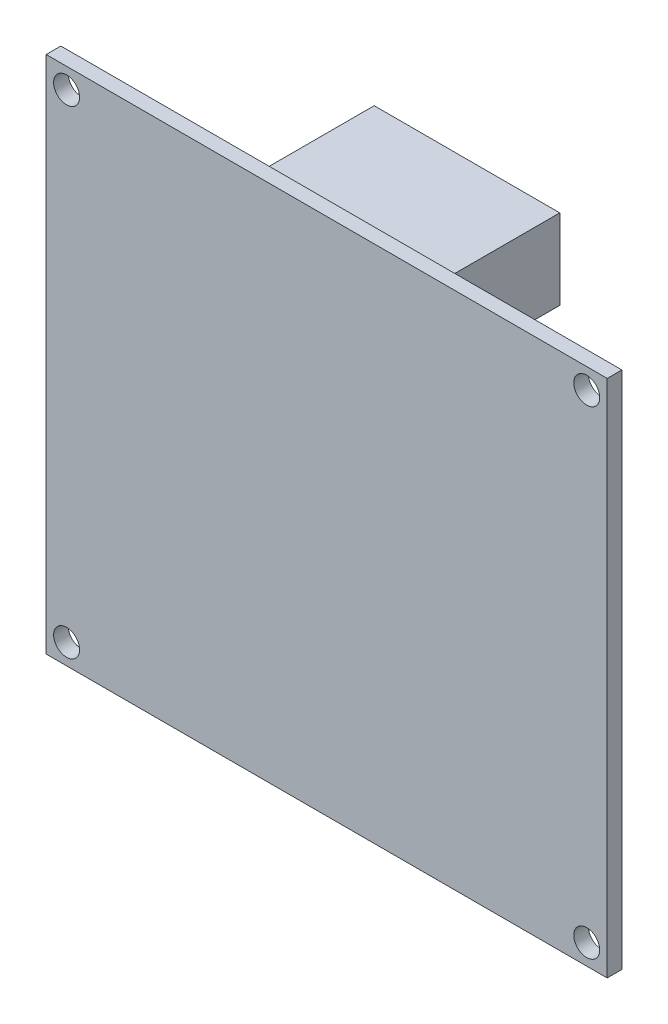
ISO-10303-21;
HEADER;
FILE_DESCRIPTION(('STEP AP214'),'2;1');
FILE_NAME('part.step','',(''),(''),'','','');
FILE_SCHEMA(('AUTOMOTIVE_DESIGN { 1 0 10303 214 1 1 1 1 }'));
ENDSEC;
DATA;
#1=APPLICATION_CONTEXT('core data for automotive mechanical design processes');
#2=APPLICATION_PROTOCOL_DEFINITION('international standard','automotive_design',2000,#1);
#3=PRODUCT_CONTEXT('',#1,'mechanical');
#4=PRODUCT('Part','Part','',(#3));
#5=PRODUCT_RELATED_PRODUCT_CATEGORY('part','',(#4));
#6=PRODUCT_DEFINITION_FORMATION('','',#4);
#7=PRODUCT_DEFINITION_CONTEXT('part definition',#1,'design');
#8=PRODUCT_DEFINITION('design','',#6,#7);
#9=PRODUCT_DEFINITION_SHAPE('','',#8);
#10=(LENGTH_UNIT() NAMED_UNIT(*) SI_UNIT(.MILLI.,.METRE.));
#11=(NAMED_UNIT(*) PLANE_ANGLE_UNIT() SI_UNIT($,.RADIAN.));
#12=(NAMED_UNIT(*) SI_UNIT($,.STERADIAN.) SOLID_ANGLE_UNIT());
#13=UNCERTAINTY_MEASURE_WITH_UNIT(LENGTH_MEASURE(1.E-05),#10,'distance_accuracy_value','');
#14=(GEOMETRIC_REPRESENTATION_CONTEXT(3) GLOBAL_UNCERTAINTY_ASSIGNED_CONTEXT((#13)) GLOBAL_UNIT_ASSIGNED_CONTEXT((#10,
#11,#12)) REPRESENTATION_CONTEXT('',''));
#15=CARTESIAN_POINT('',(0.,0.,0.));
#16=DIRECTION('',(0.,0.,1.));
#17=DIRECTION('',(1.,0.,0.));
#18=AXIS2_PLACEMENT_3D('',#15,#16,#17);
#19=CARTESIAN_POINT('',(31.5595,29.21,-0.8255));
#20=DIRECTION('',(0.,0.,-1.));
#21=DIRECTION('',(-1.,0.,0.));
#22=AXIS2_PLACEMENT_3D('',#19,#20,#21);
#23=PLANE('',#22);
#24=CARTESIAN_POINT('',(-29.25826,-26.9113,-0.8255));
#25=DIRECTION('',(0.,0.,-1.));
#26=DIRECTION('',(-1.,0.,0.));
#27=AXIS2_PLACEMENT_3D('',#24,#25,#26);
#28=CIRCLE('',#27,1.4605);
#29=CARTESIAN_POINT('',(-30.71876,-26.9113,-0.8255));
#30=VERTEX_POINT('',#29);
#31=EDGE_CURVE('E222',#30,#30,#28,.T.);
#32=ORIENTED_EDGE('',*,*,#31,.F.);
#33=EDGE_LOOP('',(#32));
#34=FACE_BOUND('',#33,.T.);
#35=CARTESIAN_POINT('',(29.25826,-26.9113,-0.8255));
#36=DIRECTION('',(0.,0.,-1.));
#37=DIRECTION('',(-1.,0.,0.));
#38=AXIS2_PLACEMENT_3D('',#35,#36,#37);
#39=CIRCLE('',#38,1.4605);
#40=CARTESIAN_POINT('',(27.79776,-26.9113,-0.8255));
#41=VERTEX_POINT('',#40);
#42=EDGE_CURVE('E232',#41,#41,#39,.T.);
#43=ORIENTED_EDGE('',*,*,#42,.F.);
#44=EDGE_LOOP('',(#43));
#45=FACE_BOUND('',#44,.T.);
#46=CARTESIAN_POINT('',(29.25826,26.9113,-0.8255));
#47=DIRECTION('',(0.,0.,-1.));
#48=DIRECTION('',(-1.,0.,0.));
#49=AXIS2_PLACEMENT_3D('',#46,#47,#48);
#50=CIRCLE('',#49,1.4605);
#51=CARTESIAN_POINT('',(27.79776,26.9113,-0.8255));
#52=VERTEX_POINT('',#51);
#53=EDGE_CURVE('E238',#52,#52,#50,.T.);
#54=ORIENTED_EDGE('',*,*,#53,.F.);
#55=EDGE_LOOP('',(#54));
#56=FACE_BOUND('',#55,.T.);
#57=CARTESIAN_POINT('',(-29.25826,26.9113,-0.8255));
#58=DIRECTION('',(0.,0.,-1.));
#59=DIRECTION('',(-1.,0.,0.));
#60=AXIS2_PLACEMENT_3D('',#57,#58,#59);
#61=CIRCLE('',#60,1.4605);
#62=CARTESIAN_POINT('',(-30.71876,26.9113,-0.8255));
#63=VERTEX_POINT('',#62);
#64=EDGE_CURVE('E244',#63,#63,#61,.T.);
#65=ORIENTED_EDGE('',*,*,#64,.F.);
#66=EDGE_LOOP('',(#65));
#67=FACE_BOUND('',#66,.T.);
#68=DIRECTION('',(0.,1.,0.));
#69=VECTOR('',#68,1.);
#70=CARTESIAN_POINT('',(31.5595,-29.21,-0.8255));
#71=LINE('',#70,#69);
#72=CARTESIAN_POINT('',(31.5595,-29.21,-0.8255));
#73=VERTEX_POINT('',#72);
#74=CARTESIAN_POINT('',(31.5595,29.21,-0.8255));
#75=VERTEX_POINT('',#74);
#76=EDGE_CURVE('E136',#73,#75,#71,.T.);
#77=ORIENTED_EDGE('',*,*,#76,.F.);
#78=DIRECTION('',(1.,0.,0.));
#79=VECTOR('',#78,1.);
#80=CARTESIAN_POINT('',(-31.5595,-29.21,-0.8255));
#81=LINE('',#80,#79);
#82=CARTESIAN_POINT('',(-31.5595,-29.21,-0.8255));
#83=VERTEX_POINT('',#82);
#84=EDGE_CURVE('E82',#83,#73,#81,.T.);
#85=ORIENTED_EDGE('',*,*,#84,.F.);
#86=DIRECTION('',(0.,-1.,0.));
#87=VECTOR('',#86,1.);
#88=CARTESIAN_POINT('',(-31.5595,-29.21,-0.8255));
#89=LINE('',#88,#87);
#90=CARTESIAN_POINT('',(-31.5595,29.21,-0.8255));
#91=VERTEX_POINT('',#90);
#92=EDGE_CURVE('E152',#91,#83,#89,.T.);
#93=ORIENTED_EDGE('',*,*,#92,.F.);
#94=DIRECTION('',(-1.,0.,0.));
#95=VECTOR('',#94,1.);
#96=CARTESIAN_POINT('',(-31.5595,29.21,-0.8255));
#97=LINE('',#96,#95);
#98=EDGE_CURVE('E139',#75,#91,#97,.T.);
#99=ORIENTED_EDGE('',*,*,#98,.F.);
#100=EDGE_LOOP('',(#77,#85,#93,#99));
#101=FACE_BOUND('',#100,.T.);
#102=DIRECTION('',(-1.,0.,0.));
#103=VECTOR('',#102,1.);
#104=CARTESIAN_POINT('',(11.4935,18.923,-0.8255));
#105=LINE('',#104,#103);
#106=CARTESIAN_POINT('',(11.4935,18.923,-0.8255));
#107=VERTEX_POINT('',#106);
#108=CARTESIAN_POINT('',(-9.38529999999999,18.923,-0.8255));
#109=VERTEX_POINT('',#108);
#110=EDGE_CURVE('E251',#107,#109,#105,.T.);
#111=ORIENTED_EDGE('',*,*,#110,.F.);
#112=DIRECTION('',(0.,-1.,0.));
#113=VECTOR('',#112,1.);
#114=CARTESIAN_POINT('',(11.4935,18.923,-0.8255));
#115=LINE('',#114,#113);
#116=CARTESIAN_POINT('',(11.4935,27.94,-0.8255));
#117=VERTEX_POINT('',#116);
#118=EDGE_CURVE('E134',#117,#107,#115,.T.);
#119=ORIENTED_EDGE('',*,*,#118,.F.);
#120=DIRECTION('',(1.,0.,0.));
#121=VECTOR('',#120,1.);
#122=CARTESIAN_POINT('',(11.4935,27.94,-0.8255));
#123=LINE('',#122,#121);
#124=CARTESIAN_POINT('',(-9.38529999999999,27.94,-0.8255));
#125=VERTEX_POINT('',#124);
#126=EDGE_CURVE('E130',#125,#117,#123,.T.);
#127=ORIENTED_EDGE('',*,*,#126,.F.);
#128=DIRECTION('',(0.,1.,0.));
#129=VECTOR('',#128,1.);
#130=CARTESIAN_POINT('',(-9.38529999999999,18.923,-0.8255));
#131=LINE('',#130,#129);
#132=EDGE_CURVE('E253',#109,#125,#131,.T.);
#133=ORIENTED_EDGE('',*,*,#132,.F.);
#134=EDGE_LOOP('',(#111,#119,#127,#133));
#135=FACE_BOUND('',#134,.T.);
#136=ADVANCED_FACE('F37',(#34,#45,#56,#67,#101,#135),#23,.T.);
#137=CARTESIAN_POINT('',(31.5595,-29.21,0.8255));
#138=DIRECTION('',(-1.,0.,0.));
#139=DIRECTION('',(0.,0.,1.));
#140=AXIS2_PLACEMENT_3D('',#137,#138,#139);
#141=PLANE('',#140);
#142=ORIENTED_EDGE('',*,*,#76,.T.);
#143=DIRECTION('',(0.,0.,-1.));
#144=VECTOR('',#143,1.);
#145=CARTESIAN_POINT('',(31.5595,29.21,0.8255));
#146=LINE('',#145,#144);
#147=CARTESIAN_POINT('',(31.5595,29.21,0.8255));
#148=VERTEX_POINT('',#147);
#149=EDGE_CURVE('E11',#148,#75,#146,.T.);
#150=ORIENTED_EDGE('',*,*,#149,.F.);
#151=DIRECTION('',(0.,1.,0.));
#152=VECTOR('',#151,1.);
#153=CARTESIAN_POINT('',(31.5595,-29.21,0.8255));
#154=LINE('',#153,#152);
#155=CARTESIAN_POINT('',(31.5595,-29.21,0.8255));
#156=VERTEX_POINT('',#155);
#157=EDGE_CURVE('E144',#156,#148,#154,.T.);
#158=ORIENTED_EDGE('',*,*,#157,.F.);
#159=DIRECTION('',(0.,0.,-1.));
#160=VECTOR('',#159,1.);
#161=CARTESIAN_POINT('',(31.5595,-29.21,0.8255));
#162=LINE('',#161,#160);
#163=EDGE_CURVE('E149',#156,#73,#162,.T.);
#164=ORIENTED_EDGE('',*,*,#163,.T.);
#165=EDGE_LOOP('',(#142,#150,#158,#164));
#166=FACE_BOUND('',#165,.T.);
#167=ADVANCED_FACE('F39',(#166),#141,.F.);
#168=CARTESIAN_POINT('',(-31.5595,29.21,0.8255));
#169=DIRECTION('',(0.,-1.,0.));
#170=DIRECTION('',(1.,0.,0.));
#171=AXIS2_PLACEMENT_3D('',#168,#169,#170);
#172=PLANE('',#171);
#173=ORIENTED_EDGE('',*,*,#98,.T.);
#174=DIRECTION('',(0.,0.,-1.));
#175=VECTOR('',#174,1.);
#176=CARTESIAN_POINT('',(-31.5595,29.21,0.8255));
#177=LINE('',#176,#175);
#178=CARTESIAN_POINT('',(-31.5595,29.21,0.8255));
#179=VERTEX_POINT('',#178);
#180=EDGE_CURVE('E45',#179,#91,#177,.T.);
#181=ORIENTED_EDGE('',*,*,#180,.F.);
#182=DIRECTION('',(-1.,0.,0.));
#183=VECTOR('',#182,1.);
#184=CARTESIAN_POINT('',(-31.5595,29.21,0.8255));
#185=LINE('',#184,#183);
#186=EDGE_CURVE('E89',#148,#179,#185,.T.);
#187=ORIENTED_EDGE('',*,*,#186,.F.);
#188=ORIENTED_EDGE('',*,*,#149,.T.);
#189=EDGE_LOOP('',(#173,#181,#187,#188));
#190=FACE_BOUND('',#189,.T.);
#191=ADVANCED_FACE('F179',(#190),#172,.F.);
#192=CARTESIAN_POINT('',(-31.5595,-29.21,0.8255));
#193=DIRECTION('',(1.,0.,0.));
#194=DIRECTION('',(0.,0.,-1.));
#195=AXIS2_PLACEMENT_3D('',#192,#193,#194);
#196=PLANE('',#195);
#197=ORIENTED_EDGE('',*,*,#92,.T.);
#198=DIRECTION('',(0.,0.,-1.));
#199=VECTOR('',#198,1.);
#200=CARTESIAN_POINT('',(-31.5595,-29.21,0.8255));
#201=LINE('',#200,#199);
#202=CARTESIAN_POINT('',(-31.5595,-29.21,0.8255));
#203=VERTEX_POINT('',#202);
#204=EDGE_CURVE('E156',#203,#83,#201,.T.);
#205=ORIENTED_EDGE('',*,*,#204,.F.);
#206=DIRECTION('',(0.,-1.,0.));
#207=VECTOR('',#206,1.);
#208=CARTESIAN_POINT('',(-31.5595,-29.21,0.8255));
#209=LINE('',#208,#207);
#210=EDGE_CURVE('E147',#179,#203,#209,.T.);
#211=ORIENTED_EDGE('',*,*,#210,.F.);
#212=ORIENTED_EDGE('',*,*,#180,.T.);
#213=EDGE_LOOP('',(#197,#205,#211,#212));
#214=FACE_BOUND('',#213,.T.);
#215=ADVANCED_FACE('F161',(#214),#196,.F.);
#216=CARTESIAN_POINT('',(-31.5595,-29.21,0.8255));
#217=DIRECTION('',(0.,1.,0.));
#218=DIRECTION('',(0.,0.,1.));
#219=AXIS2_PLACEMENT_3D('',#216,#217,#218);
#220=PLANE('',#219);
#221=ORIENTED_EDGE('',*,*,#84,.T.);
#222=ORIENTED_EDGE('',*,*,#163,.F.);
#223=DIRECTION('',(1.,0.,0.));
#224=VECTOR('',#223,1.);
#225=CARTESIAN_POINT('',(-31.5595,-29.21,0.8255));
#226=LINE('',#225,#224);
#227=EDGE_CURVE('E61',#203,#156,#226,.T.);
#228=ORIENTED_EDGE('',*,*,#227,.F.);
#229=ORIENTED_EDGE('',*,*,#204,.T.);
#230=EDGE_LOOP('',(#221,#222,#228,#229));
#231=FACE_BOUND('',#230,.T.);
#232=ADVANCED_FACE('F169',(#231),#220,.F.);
#233=CARTESIAN_POINT('',(31.5595,29.21,0.8255));
#234=DIRECTION('',(0.,0.,-1.));
#235=DIRECTION('',(-1.,0.,0.));
#236=AXIS2_PLACEMENT_3D('',#233,#234,#235);
#237=PLANE('',#236);
#238=CARTESIAN_POINT('',(-29.25826,-26.9113,0.8255));
#239=DIRECTION('',(0.,0.,1.));
#240=DIRECTION('',(-1.,0.,0.));
#241=AXIS2_PLACEMENT_3D('',#238,#239,#240);
#242=CIRCLE('',#241,1.4605);
#243=CARTESIAN_POINT('',(-30.71876,-26.9113,0.8255));
#244=VERTEX_POINT('',#243);
#245=EDGE_CURVE('E225',#244,#244,#242,.T.);
#246=ORIENTED_EDGE('',*,*,#245,.F.);
#247=EDGE_LOOP('',(#246));
#248=FACE_BOUND('',#247,.T.);
#249=CARTESIAN_POINT('',(29.25826,-26.9113,0.8255));
#250=DIRECTION('',(0.,0.,1.));
#251=DIRECTION('',(1.,0.,0.));
#252=AXIS2_PLACEMENT_3D('',#249,#250,#251);
#253=CIRCLE('',#252,1.4605);
#254=CARTESIAN_POINT('',(30.71876,-26.9113,0.8255));
#255=VERTEX_POINT('',#254);
#256=EDGE_CURVE('E227',#255,#255,#253,.T.);
#257=ORIENTED_EDGE('',*,*,#256,.F.);
#258=EDGE_LOOP('',(#257));
#259=FACE_BOUND('',#258,.T.);
#260=CARTESIAN_POINT('',(29.25826,26.9113,0.8255));
#261=DIRECTION('',(0.,0.,1.));
#262=DIRECTION('',(-1.,0.,0.));
#263=AXIS2_PLACEMENT_3D('',#260,#261,#262);
#264=CIRCLE('',#263,1.4605);
#265=CARTESIAN_POINT('',(27.79776,26.9113,0.8255));
#266=VERTEX_POINT('',#265);
#267=EDGE_CURVE('E235',#266,#266,#264,.T.);
#268=ORIENTED_EDGE('',*,*,#267,.F.);
#269=EDGE_LOOP('',(#268));
#270=FACE_BOUND('',#269,.T.);
#271=CARTESIAN_POINT('',(-29.25826,26.9113,0.8255));
#272=DIRECTION('',(0.,0.,1.));
#273=DIRECTION('',(1.,0.,0.));
#274=AXIS2_PLACEMENT_3D('',#271,#272,#273);
#275=CIRCLE('',#274,1.4605);
#276=CARTESIAN_POINT('',(-27.79776,26.9113,0.8255));
#277=VERTEX_POINT('',#276);
#278=EDGE_CURVE('E241',#277,#277,#275,.T.);
#279=ORIENTED_EDGE('',*,*,#278,.F.);
#280=EDGE_LOOP('',(#279));
#281=FACE_BOUND('',#280,.T.);
#282=ORIENTED_EDGE('',*,*,#157,.T.);
#283=ORIENTED_EDGE('',*,*,#186,.T.);
#284=ORIENTED_EDGE('',*,*,#210,.T.);
#285=ORIENTED_EDGE('',*,*,#227,.T.);
#286=EDGE_LOOP('',(#282,#283,#284,#285));
#287=FACE_BOUND('',#286,.T.);
#288=ADVANCED_FACE('F171',(#248,#259,#270,#281,#287),#237,.F.);
#289=CARTESIAN_POINT('',(11.4935,18.923,-13.9065));
#290=DIRECTION('',(-1.,0.,0.));
#291=DIRECTION('',(0.,0.,1.));
#292=AXIS2_PLACEMENT_3D('',#289,#290,#291);
#293=PLANE('',#292);
#294=ORIENTED_EDGE('',*,*,#118,.T.);
#295=DIRECTION('',(0.,0.,1.));
#296=VECTOR('',#295,1.);
#297=CARTESIAN_POINT('',(11.4935,18.923,-13.9065));
#298=LINE('',#297,#296);
#299=CARTESIAN_POINT('',(11.4935,18.923,-13.9065));
#300=VERTEX_POINT('',#299);
#301=EDGE_CURVE('E115',#300,#107,#298,.T.);
#302=ORIENTED_EDGE('',*,*,#301,.F.);
#303=DIRECTION('',(0.,-1.,0.));
#304=VECTOR('',#303,1.);
#305=CARTESIAN_POINT('',(11.4935,18.923,-13.9065));
#306=LINE('',#305,#304);
#307=CARTESIAN_POINT('',(11.4935,27.94,-13.9065));
#308=VERTEX_POINT('',#307);
#309=EDGE_CURVE('E122',#308,#300,#306,.T.);
#310=ORIENTED_EDGE('',*,*,#309,.F.);
#311=DIRECTION('',(0.,0.,1.));
#312=VECTOR('',#311,1.);
#313=CARTESIAN_POINT('',(11.4935,27.94,-13.9065));
#314=LINE('',#313,#312);
#315=EDGE_CURVE('E249',#308,#117,#314,.T.);
#316=ORIENTED_EDGE('',*,*,#315,.T.);
#317=EDGE_LOOP('',(#294,#302,#310,#316));
#318=FACE_BOUND('',#317,.T.);
#319=ADVANCED_FACE('F132',(#318),#293,.F.);
#320=CARTESIAN_POINT('',(11.4935,18.923,-13.9065));
#321=DIRECTION('',(0.,1.,0.));
#322=DIRECTION('',(0.,0.,1.));
#323=AXIS2_PLACEMENT_3D('',#320,#321,#322);
#324=PLANE('',#323);
#325=ORIENTED_EDGE('',*,*,#110,.T.);
#326=DIRECTION('',(0.,0.,1.));
#327=VECTOR('',#326,1.);
#328=CARTESIAN_POINT('',(-9.38529999999999,18.923,-13.9065));
#329=LINE('',#328,#327);
#330=CARTESIAN_POINT('',(-9.38529999999999,18.923,-13.9065));
#331=VERTEX_POINT('',#330);
#332=EDGE_CURVE('E118',#331,#109,#329,.T.);
#333=ORIENTED_EDGE('',*,*,#332,.F.);
#334=DIRECTION('',(-1.,0.,0.));
#335=VECTOR('',#334,1.);
#336=CARTESIAN_POINT('',(11.4935,18.923,-13.9065));
#337=LINE('',#336,#335);
#338=EDGE_CURVE('E111',#300,#331,#337,.T.);
#339=ORIENTED_EDGE('',*,*,#338,.F.);
#340=ORIENTED_EDGE('',*,*,#301,.T.);
#341=EDGE_LOOP('',(#325,#333,#339,#340));
#342=FACE_BOUND('',#341,.T.);
#343=ADVANCED_FACE('F113',(#342),#324,.F.);
#344=CARTESIAN_POINT('',(-9.38529999999999,18.923,-13.9065));
#345=DIRECTION('',(1.,0.,0.));
#346=DIRECTION('',(0.,0.,-1.));
#347=AXIS2_PLACEMENT_3D('',#344,#345,#346);
#348=PLANE('',#347);
#349=ORIENTED_EDGE('',*,*,#132,.T.);
#350=DIRECTION('',(0.,0.,1.));
#351=VECTOR('',#350,1.);
#352=CARTESIAN_POINT('',(-9.38529999999999,27.94,-13.9065));
#353=LINE('',#352,#351);
#354=CARTESIAN_POINT('',(-9.38529999999999,27.94,-13.9065));
#355=VERTEX_POINT('',#354);
#356=EDGE_CURVE('E52',#355,#125,#353,.T.);
#357=ORIENTED_EDGE('',*,*,#356,.F.);
#358=DIRECTION('',(0.,1.,0.));
#359=VECTOR('',#358,1.);
#360=CARTESIAN_POINT('',(-9.38529999999999,18.923,-13.9065));
#361=LINE('',#360,#359);
#362=EDGE_CURVE('E121',#331,#355,#361,.T.);
#363=ORIENTED_EDGE('',*,*,#362,.F.);
#364=ORIENTED_EDGE('',*,*,#332,.T.);
#365=EDGE_LOOP('',(#349,#357,#363,#364));
#366=FACE_BOUND('',#365,.T.);
#367=ADVANCED_FACE('F194',(#366),#348,.F.);
#368=CARTESIAN_POINT('',(11.4935,27.94,-13.9065));
#369=DIRECTION('',(0.,-1.,0.));
#370=DIRECTION('',(1.,0.,0.));
#371=AXIS2_PLACEMENT_3D('',#368,#369,#370);
#372=PLANE('',#371);
#373=ORIENTED_EDGE('',*,*,#126,.T.);
#374=ORIENTED_EDGE('',*,*,#315,.F.);
#375=DIRECTION('',(1.,0.,0.));
#376=VECTOR('',#375,1.);
#377=CARTESIAN_POINT('',(11.4935,27.94,-13.9065));
#378=LINE('',#377,#376);
#379=EDGE_CURVE('E126',#355,#308,#378,.T.);
#380=ORIENTED_EDGE('',*,*,#379,.F.);
#381=ORIENTED_EDGE('',*,*,#356,.T.);
#382=EDGE_LOOP('',(#373,#374,#380,#381));
#383=FACE_BOUND('',#382,.T.);
#384=ADVANCED_FACE('F197',(#383),#372,.F.);
#385=CARTESIAN_POINT('',(11.4935,27.94,-13.9065));
#386=DIRECTION('',(0.,0.,1.));
#387=DIRECTION('',(1.,0.,0.));
#388=AXIS2_PLACEMENT_3D('',#385,#386,#387);
#389=PLANE('',#388);
#390=ORIENTED_EDGE('',*,*,#309,.T.);
#391=ORIENTED_EDGE('',*,*,#338,.T.);
#392=ORIENTED_EDGE('',*,*,#362,.T.);
#393=ORIENTED_EDGE('',*,*,#379,.T.);
#394=EDGE_LOOP('',(#390,#391,#392,#393));
#395=FACE_BOUND('',#394,.T.);
#396=ADVANCED_FACE('F125',(#395),#389,.F.);
#397=CARTESIAN_POINT('',(-29.25826,26.9113,-13.9065));
#398=DIRECTION('',(0.,0.,1.));
#399=DIRECTION('',(1.,0.,0.));
#400=AXIS2_PLACEMENT_3D('',#397,#398,#399);
#401=CYLINDRICAL_SURFACE('',#400,1.4605);
#402=ORIENTED_EDGE('',*,*,#64,.T.);
#403=EDGE_LOOP('',(#402));
#404=FACE_BOUND('',#403,.T.);
#405=ORIENTED_EDGE('',*,*,#278,.T.);
#406=EDGE_LOOP('',(#405));
#407=FACE_BOUND('',#406,.T.);
#408=ADVANCED_FACE('F203',(#404,#407),#401,.F.);
#409=CARTESIAN_POINT('',(29.25826,26.9113,-13.9065));
#410=DIRECTION('',(0.,0.,1.));
#411=DIRECTION('',(1.,0.,0.));
#412=AXIS2_PLACEMENT_3D('',#409,#410,#411);
#413=CYLINDRICAL_SURFACE('',#412,1.4605);
#414=ORIENTED_EDGE('',*,*,#53,.T.);
#415=EDGE_LOOP('',(#414));
#416=FACE_BOUND('',#415,.T.);
#417=ORIENTED_EDGE('',*,*,#267,.T.);
#418=EDGE_LOOP('',(#417));
#419=FACE_BOUND('',#418,.T.);
#420=ADVANCED_FACE('F206',(#416,#419),#413,.F.);
#421=CARTESIAN_POINT('',(29.25826,-26.9113,-13.9065));
#422=DIRECTION('',(0.,0.,1.));
#423=DIRECTION('',(1.,0.,0.));
#424=AXIS2_PLACEMENT_3D('',#421,#422,#423);
#425=CYLINDRICAL_SURFACE('',#424,1.4605);
#426=ORIENTED_EDGE('',*,*,#42,.T.);
#427=EDGE_LOOP('',(#426));
#428=FACE_BOUND('',#427,.T.);
#429=ORIENTED_EDGE('',*,*,#256,.T.);
#430=EDGE_LOOP('',(#429));
#431=FACE_BOUND('',#430,.T.);
#432=ADVANCED_FACE('F210',(#428,#431),#425,.F.);
#433=CARTESIAN_POINT('',(-29.25826,-26.9113,-13.9065));
#434=DIRECTION('',(0.,0.,1.));
#435=DIRECTION('',(1.,0.,0.));
#436=AXIS2_PLACEMENT_3D('',#433,#434,#435);
#437=CYLINDRICAL_SURFACE('',#436,1.4605);
#438=ORIENTED_EDGE('',*,*,#31,.T.);
#439=EDGE_LOOP('',(#438));
#440=FACE_BOUND('',#439,.T.);
#441=ORIENTED_EDGE('',*,*,#245,.T.);
#442=EDGE_LOOP('',(#441));
#443=FACE_BOUND('',#442,.T.);
#444=ADVANCED_FACE('F214',(#440,#443),#437,.F.);
#445=CLOSED_SHELL('',(#136,#167,#191,#215,#232,#288,#319,#343,#367,#384,#396,#408,#420,#432,#444));
#446=MANIFOLD_SOLID_BREP('B2',#445);
#447=ADVANCED_BREP_SHAPE_REPRESENTATION('',(#18,#446),#14);
#448=SHAPE_DEFINITION_REPRESENTATION(#9,#447);
ENDSEC;
END-ISO-10303-21;
